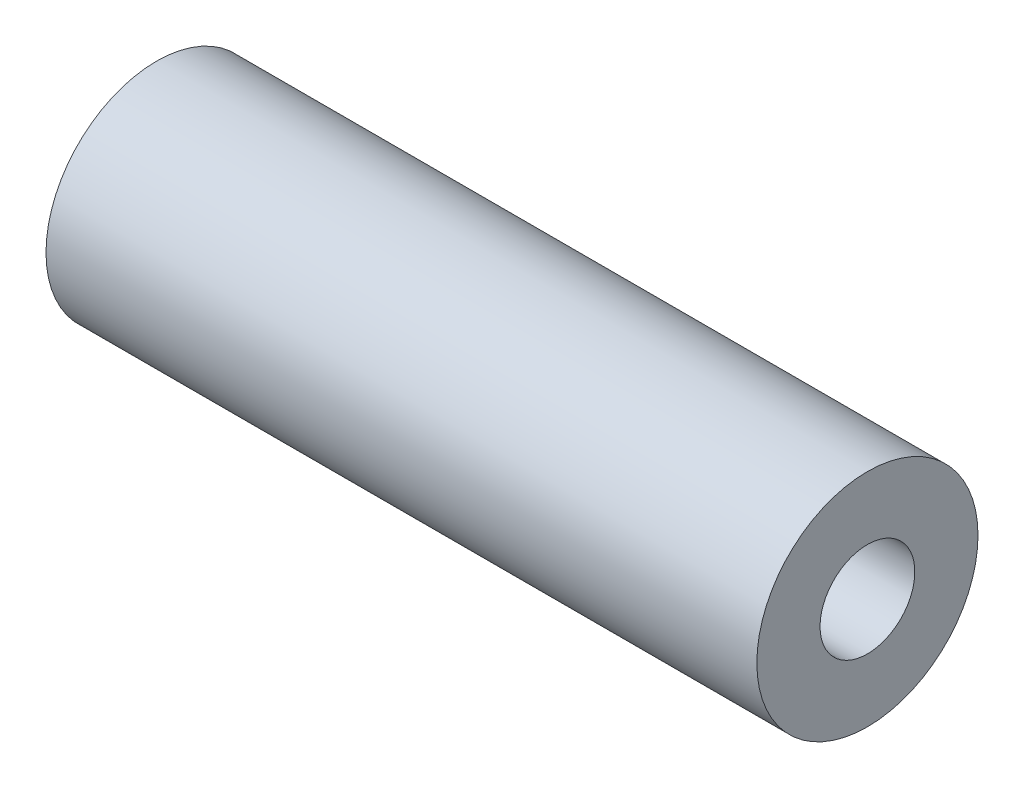
ISO-10303-21;
HEADER;
FILE_DESCRIPTION(('STEP AP214'),'2;1');
FILE_NAME('part.step','',(''),(''),'','','');
FILE_SCHEMA(('AUTOMOTIVE_DESIGN { 1 0 10303 214 1 1 1 1 }'));
ENDSEC;
DATA;
#1=APPLICATION_CONTEXT('core data for automotive mechanical design processes');
#2=APPLICATION_PROTOCOL_DEFINITION('international standard','automotive_design',2000,#1);
#3=PRODUCT_CONTEXT('',#1,'mechanical');
#4=PRODUCT('Part','Part','',(#3));
#5=PRODUCT_RELATED_PRODUCT_CATEGORY('part','',(#4));
#6=PRODUCT_DEFINITION_FORMATION('','',#4);
#7=PRODUCT_DEFINITION_CONTEXT('part definition',#1,'design');
#8=PRODUCT_DEFINITION('design','',#6,#7);
#9=PRODUCT_DEFINITION_SHAPE('','',#8);
#10=(LENGTH_UNIT() NAMED_UNIT(*) SI_UNIT(.MILLI.,.METRE.));
#11=(NAMED_UNIT(*) PLANE_ANGLE_UNIT() SI_UNIT($,.RADIAN.));
#12=(NAMED_UNIT(*) SI_UNIT($,.STERADIAN.) SOLID_ANGLE_UNIT());
#13=UNCERTAINTY_MEASURE_WITH_UNIT(LENGTH_MEASURE(1.E-05),#10,'distance_accuracy_value','');
#14=(GEOMETRIC_REPRESENTATION_CONTEXT(3) GLOBAL_UNCERTAINTY_ASSIGNED_CONTEXT((#13)) GLOBAL_UNIT_ASSIGNED_CONTEXT((#10,
#11,#12)) REPRESENTATION_CONTEXT('',''));
#15=CARTESIAN_POINT('',(0.,0.,0.));
#16=DIRECTION('',(0.,0.,1.));
#17=DIRECTION('',(1.,0.,0.));
#18=AXIS2_PLACEMENT_3D('',#15,#16,#17);
#19=CARTESIAN_POINT('',(-22.5,7.,0.));
#20=DIRECTION('',(1.,0.,0.));
#21=DIRECTION('',(0.,0.,-1.));
#22=AXIS2_PLACEMENT_3D('',#19,#20,#21);
#23=PLANE('',#22);
#24=CARTESIAN_POINT('',(-22.5,0.,0.));
#25=DIRECTION('',(-1.,0.,0.));
#26=DIRECTION('',(0.,0.,1.));
#27=AXIS2_PLACEMENT_3D('',#24,#25,#26);
#28=CIRCLE('',#27,3.);
#29=CARTESIAN_POINT('',(-22.5,0.,3.));
#30=VERTEX_POINT('',#29);
#31=EDGE_CURVE('E10',#30,#30,#28,.T.);
#32=ORIENTED_EDGE('',*,*,#31,.F.);
#33=EDGE_LOOP('',(#32));
#34=FACE_BOUND('',#33,.T.);
#35=CARTESIAN_POINT('',(-22.5,0.,0.));
#36=DIRECTION('',(-1.,0.,0.));
#37=DIRECTION('',(0.,0.,1.));
#38=AXIS2_PLACEMENT_3D('',#35,#36,#37);
#39=CIRCLE('',#38,7.);
#40=CARTESIAN_POINT('',(-22.5,0.,7.));
#41=VERTEX_POINT('',#40);
#42=EDGE_CURVE('E43',#41,#41,#39,.T.);
#43=ORIENTED_EDGE('',*,*,#42,.T.);
#44=EDGE_LOOP('',(#43));
#45=FACE_BOUND('',#44,.T.);
#46=ADVANCED_FACE('F29',(#34,#45),#23,.F.);
#47=CARTESIAN_POINT('',(-37.0031632185857,0.,0.));
#48=DIRECTION('',(-1.,0.,0.));
#49=DIRECTION('',(0.,0.,1.));
#50=AXIS2_PLACEMENT_3D('',#47,#48,#49);
#51=CYLINDRICAL_SURFACE('',#50,3.);
#52=CARTESIAN_POINT('',(22.5,0.,0.));
#53=DIRECTION('',(-1.,0.,0.));
#54=DIRECTION('',(0.,0.,1.));
#55=AXIS2_PLACEMENT_3D('',#52,#53,#54);
#56=CIRCLE('',#55,3.);
#57=CARTESIAN_POINT('',(22.5,0.,3.));
#58=VERTEX_POINT('',#57);
#59=EDGE_CURVE('E35',#58,#58,#56,.T.);
#60=ORIENTED_EDGE('',*,*,#59,.F.);
#61=EDGE_LOOP('',(#60));
#62=FACE_BOUND('',#61,.T.);
#63=ORIENTED_EDGE('',*,*,#31,.T.);
#64=EDGE_LOOP('',(#63));
#65=FACE_BOUND('',#64,.T.);
#66=ADVANCED_FACE('F58',(#62,#65),#51,.F.);
#67=CARTESIAN_POINT('',(22.5,7.,0.));
#68=DIRECTION('',(-1.,0.,0.));
#69=DIRECTION('',(0.,0.,1.));
#70=AXIS2_PLACEMENT_3D('',#67,#68,#69);
#71=PLANE('',#70);
#72=CARTESIAN_POINT('',(22.5,0.,0.));
#73=DIRECTION('',(-1.,0.,0.));
#74=DIRECTION('',(0.,0.,1.));
#75=AXIS2_PLACEMENT_3D('',#72,#73,#74);
#76=CIRCLE('',#75,7.);
#77=CARTESIAN_POINT('',(22.5,0.,7.));
#78=VERTEX_POINT('',#77);
#79=EDGE_CURVE('E39',#78,#78,#76,.T.);
#80=ORIENTED_EDGE('',*,*,#79,.F.);
#81=EDGE_LOOP('',(#80));
#82=FACE_BOUND('',#81,.T.);
#83=ORIENTED_EDGE('',*,*,#59,.T.);
#84=EDGE_LOOP('',(#83));
#85=FACE_BOUND('',#84,.T.);
#86=ADVANCED_FACE('F53',(#82,#85),#71,.F.);
#87=CARTESIAN_POINT('',(-37.0031632185857,0.,0.));
#88=DIRECTION('',(-1.,0.,0.));
#89=DIRECTION('',(0.,0.,1.));
#90=AXIS2_PLACEMENT_3D('',#87,#88,#89);
#91=CYLINDRICAL_SURFACE('',#90,7.);
#92=ORIENTED_EDGE('',*,*,#42,.F.);
#93=EDGE_LOOP('',(#92));
#94=FACE_BOUND('',#93,.T.);
#95=ORIENTED_EDGE('',*,*,#79,.T.);
#96=EDGE_LOOP('',(#95));
#97=FACE_BOUND('',#96,.T.);
#98=ADVANCED_FACE('F50',(#94,#97),#91,.T.);
#99=CLOSED_SHELL('',(#46,#66,#86,#98));
#100=MANIFOLD_SOLID_BREP('B2',#99);
#101=ADVANCED_BREP_SHAPE_REPRESENTATION('',(#18,#100),#14);
#102=SHAPE_DEFINITION_REPRESENTATION(#9,#101);
ENDSEC;
END-ISO-10303-21;
